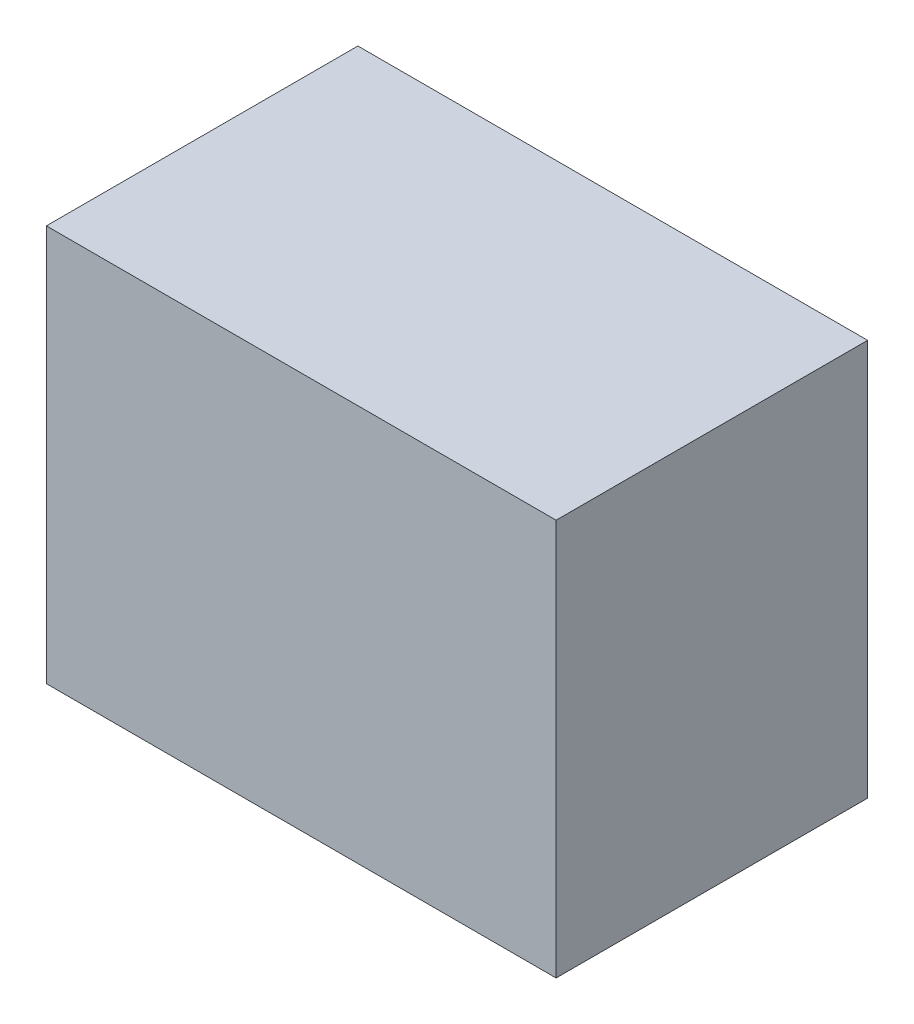
ISO-10303-21;
HEADER;
FILE_DESCRIPTION(('STEP AP214'),'2;1');
FILE_NAME('part.step','',(''),(''),'','','');
FILE_SCHEMA(('AUTOMOTIVE_DESIGN { 1 0 10303 214 1 1 1 1 }'));
ENDSEC;
DATA;
#1=APPLICATION_CONTEXT('core data for automotive mechanical design processes');
#2=APPLICATION_PROTOCOL_DEFINITION('international standard','automotive_design',2000,#1);
#3=PRODUCT_CONTEXT('',#1,'mechanical');
#4=PRODUCT('Part','Part','',(#3));
#5=PRODUCT_RELATED_PRODUCT_CATEGORY('part','',(#4));
#6=PRODUCT_DEFINITION_FORMATION('','',#4);
#7=PRODUCT_DEFINITION_CONTEXT('part definition',#1,'design');
#8=PRODUCT_DEFINITION('design','',#6,#7);
#9=PRODUCT_DEFINITION_SHAPE('','',#8);
#10=(LENGTH_UNIT() NAMED_UNIT(*) SI_UNIT(.MILLI.,.METRE.));
#11=(NAMED_UNIT(*) PLANE_ANGLE_UNIT() SI_UNIT($,.RADIAN.));
#12=(NAMED_UNIT(*) SI_UNIT($,.STERADIAN.) SOLID_ANGLE_UNIT());
#13=UNCERTAINTY_MEASURE_WITH_UNIT(LENGTH_MEASURE(1.E-05),#10,'distance_accuracy_value','');
#14=(GEOMETRIC_REPRESENTATION_CONTEXT(3) GLOBAL_UNCERTAINTY_ASSIGNED_CONTEXT((#13)) GLOBAL_UNIT_ASSIGNED_CONTEXT((#10,
#11,#12)) REPRESENTATION_CONTEXT('',''));
#15=CARTESIAN_POINT('',(0.,0.,0.));
#16=DIRECTION('',(0.,0.,1.));
#17=DIRECTION('',(1.,0.,0.));
#18=AXIS2_PLACEMENT_3D('',#15,#16,#17);
#19=CARTESIAN_POINT('',(0.90000074,0.70000114,0.));
#20=DIRECTION('',(1.,0.,0.));
#21=DIRECTION('',(0.,-1.,0.));
#22=AXIS2_PLACEMENT_3D('',#19,#20,#21);
#23=PLANE('',#22);
#24=DIRECTION('',(0.,0.,1.));
#25=VECTOR('',#24,1.);
#26=CARTESIAN_POINT('',(0.90000074,0.70000114,0.));
#27=LINE('',#26,#25);
#28=CARTESIAN_POINT('',(0.90000074,0.70000114,0.));
#29=VERTEX_POINT('',#28);
#30=CARTESIAN_POINT('',(0.90000074,0.70000114,1.10000034));
#31=VERTEX_POINT('',#30);
#32=EDGE_CURVE('E11',#29,#31,#27,.T.);
#33=ORIENTED_EDGE('',*,*,#32,.T.);
#34=DIRECTION('',(0.,-1.,0.));
#35=VECTOR('',#34,1.);
#36=CARTESIAN_POINT('',(0.90000074,0.70000114,1.10000034));
#37=LINE('',#36,#35);
#38=CARTESIAN_POINT('',(0.90000074,-0.70000114,1.10000034));
#39=VERTEX_POINT('',#38);
#40=EDGE_CURVE('E23',#31,#39,#37,.T.);
#41=ORIENTED_EDGE('',*,*,#40,.T.);
#42=DIRECTION('',(0.,0.,1.));
#43=VECTOR('',#42,1.);
#44=CARTESIAN_POINT('',(0.90000074,-0.70000114,0.));
#45=LINE('',#44,#43);
#46=CARTESIAN_POINT('',(0.90000074,-0.70000114,0.));
#47=VERTEX_POINT('',#46);
#48=EDGE_CURVE('E83',#47,#39,#45,.T.);
#49=ORIENTED_EDGE('',*,*,#48,.F.);
#50=DIRECTION('',(0.,-1.,0.));
#51=VECTOR('',#50,1.);
#52=CARTESIAN_POINT('',(0.90000074,0.70000114,0.));
#53=LINE('',#52,#51);
#54=EDGE_CURVE('E81',#29,#47,#53,.T.);
#55=ORIENTED_EDGE('',*,*,#54,.F.);
#56=EDGE_LOOP('',(#33,#41,#49,#55));
#57=FACE_BOUND('',#56,.T.);
#58=ADVANCED_FACE('F16',(#57),#23,.T.);
#59=CARTESIAN_POINT('',(0.90000074,-0.70000114,0.));
#60=DIRECTION('',(0.,-1.,0.));
#61=DIRECTION('',(-1.,0.,0.));
#62=AXIS2_PLACEMENT_3D('',#59,#60,#61);
#63=PLANE('',#62);
#64=ORIENTED_EDGE('',*,*,#48,.T.);
#65=DIRECTION('',(-1.,0.,0.));
#66=VECTOR('',#65,1.);
#67=CARTESIAN_POINT('',(0.90000074,-0.70000114,1.10000034));
#68=LINE('',#67,#66);
#69=CARTESIAN_POINT('',(-0.90000074,-0.70000114,1.10000034));
#70=VERTEX_POINT('',#69);
#71=EDGE_CURVE('E79',#39,#70,#68,.T.);
#72=ORIENTED_EDGE('',*,*,#71,.T.);
#73=DIRECTION('',(0.,0.,1.));
#74=VECTOR('',#73,1.);
#75=CARTESIAN_POINT('',(-0.90000074,-0.70000114,0.));
#76=LINE('',#75,#74);
#77=CARTESIAN_POINT('',(-0.90000074,-0.70000114,0.));
#78=VERTEX_POINT('',#77);
#79=EDGE_CURVE('E77',#78,#70,#76,.T.);
#80=ORIENTED_EDGE('',*,*,#79,.F.);
#81=DIRECTION('',(-1.,0.,0.));
#82=VECTOR('',#81,1.);
#83=CARTESIAN_POINT('',(0.90000074,-0.70000114,0.));
#84=LINE('',#83,#82);
#85=EDGE_CURVE('E57',#47,#78,#84,.T.);
#86=ORIENTED_EDGE('',*,*,#85,.F.);
#87=EDGE_LOOP('',(#64,#72,#80,#86));
#88=FACE_BOUND('',#87,.T.);
#89=ADVANCED_FACE('F89',(#88),#63,.T.);
#90=CARTESIAN_POINT('',(-0.90000074,-0.70000114,0.));
#91=DIRECTION('',(-1.,0.,0.));
#92=DIRECTION('',(0.,1.,0.));
#93=AXIS2_PLACEMENT_3D('',#90,#91,#92);
#94=PLANE('',#93);
#95=ORIENTED_EDGE('',*,*,#79,.T.);
#96=DIRECTION('',(0.,1.,0.));
#97=VECTOR('',#96,1.);
#98=CARTESIAN_POINT('',(-0.90000074,-0.70000114,1.10000034));
#99=LINE('',#98,#97);
#100=CARTESIAN_POINT('',(-0.90000074,0.70000114,1.10000034));
#101=VERTEX_POINT('',#100);
#102=EDGE_CURVE('E71',#70,#101,#99,.T.);
#103=ORIENTED_EDGE('',*,*,#102,.T.);
#104=DIRECTION('',(0.,0.,1.));
#105=VECTOR('',#104,1.);
#106=CARTESIAN_POINT('',(-0.90000074,0.70000114,0.));
#107=LINE('',#106,#105);
#108=CARTESIAN_POINT('',(-0.90000074,0.70000114,0.));
#109=VERTEX_POINT('',#108);
#110=EDGE_CURVE('E62',#109,#101,#107,.T.);
#111=ORIENTED_EDGE('',*,*,#110,.F.);
#112=DIRECTION('',(0.,1.,0.));
#113=VECTOR('',#112,1.);
#114=CARTESIAN_POINT('',(-0.90000074,-0.70000114,0.));
#115=LINE('',#114,#113);
#116=EDGE_CURVE('E53',#78,#109,#115,.T.);
#117=ORIENTED_EDGE('',*,*,#116,.F.);
#118=EDGE_LOOP('',(#95,#103,#111,#117));
#119=FACE_BOUND('',#118,.T.);
#120=ADVANCED_FACE('F69',(#119),#94,.T.);
#121=CARTESIAN_POINT('',(-0.90000074,0.70000114,0.));
#122=DIRECTION('',(0.,1.,0.));
#123=DIRECTION('',(1.,0.,0.));
#124=AXIS2_PLACEMENT_3D('',#121,#122,#123);
#125=PLANE('',#124);
#126=ORIENTED_EDGE('',*,*,#110,.T.);
#127=DIRECTION('',(1.,0.,0.));
#128=VECTOR('',#127,1.);
#129=CARTESIAN_POINT('',(-0.90000074,0.70000114,1.10000034));
#130=LINE('',#129,#128);
#131=EDGE_CURVE('E63',#101,#31,#130,.T.);
#132=ORIENTED_EDGE('',*,*,#131,.T.);
#133=ORIENTED_EDGE('',*,*,#32,.F.);
#134=DIRECTION('',(1.,0.,0.));
#135=VECTOR('',#134,1.);
#136=CARTESIAN_POINT('',(-0.90000074,0.70000114,0.));
#137=LINE('',#136,#135);
#138=EDGE_CURVE('E56',#109,#29,#137,.T.);
#139=ORIENTED_EDGE('',*,*,#138,.F.);
#140=EDGE_LOOP('',(#126,#132,#133,#139));
#141=FACE_BOUND('',#140,.T.);
#142=ADVANCED_FACE('F66',(#141),#125,.T.);
#143=CARTESIAN_POINT('',(0.,0.,0.));
#144=DIRECTION('',(0.,0.,-1.));
#145=DIRECTION('',(0.,1.,0.));
#146=AXIS2_PLACEMENT_3D('',#143,#144,#145);
#147=PLANE('',#146);
#148=ORIENTED_EDGE('',*,*,#54,.T.);
#149=ORIENTED_EDGE('',*,*,#85,.T.);
#150=ORIENTED_EDGE('',*,*,#116,.T.);
#151=ORIENTED_EDGE('',*,*,#138,.T.);
#152=EDGE_LOOP('',(#148,#149,#150,#151));
#153=FACE_BOUND('',#152,.T.);
#154=ADVANCED_FACE('F55',(#153),#147,.T.);
#155=CARTESIAN_POINT('',(0.,0.,1.10000034));
#156=DIRECTION('',(0.,0.,-1.));
#157=DIRECTION('',(0.,1.,0.));
#158=AXIS2_PLACEMENT_3D('',#155,#156,#157);
#159=PLANE('',#158);
#160=ORIENTED_EDGE('',*,*,#131,.F.);
#161=ORIENTED_EDGE('',*,*,#102,.F.);
#162=ORIENTED_EDGE('',*,*,#71,.F.);
#163=ORIENTED_EDGE('',*,*,#40,.F.);
#164=EDGE_LOOP('',(#160,#161,#162,#163));
#165=FACE_BOUND('',#164,.T.);
#166=ADVANCED_FACE('F90',(#165),#159,.F.);
#167=CLOSED_SHELL('',(#58,#89,#120,#142,#154,#166));
#168=MANIFOLD_SOLID_BREP('B1',#167);
#169=ADVANCED_BREP_SHAPE_REPRESENTATION('',(#18,#168),#14);
#170=SHAPE_DEFINITION_REPRESENTATION(#9,#169);
ENDSEC;
END-ISO-10303-21;
